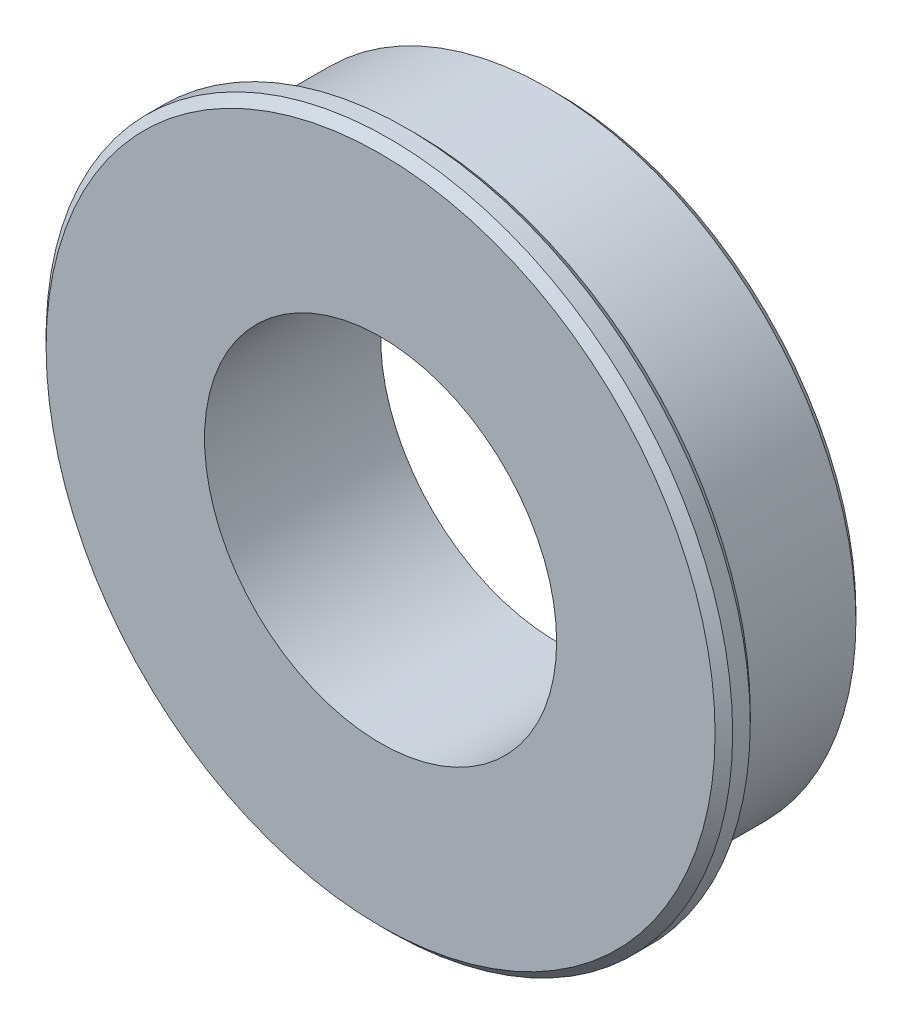
ISO-10303-21;
HEADER;
FILE_DESCRIPTION(('STEP AP214'),'2;1');
FILE_NAME('part.step','',(''),(''),'','','');
FILE_SCHEMA(('AUTOMOTIVE_DESIGN { 1 0 10303 214 1 1 1 1 }'));
ENDSEC;
DATA;
#1=APPLICATION_CONTEXT('core data for automotive mechanical design processes');
#2=APPLICATION_PROTOCOL_DEFINITION('international standard','automotive_design',2000,#1);
#3=PRODUCT_CONTEXT('',#1,'mechanical');
#4=PRODUCT('Part','Part','',(#3));
#5=PRODUCT_RELATED_PRODUCT_CATEGORY('part','',(#4));
#6=PRODUCT_DEFINITION_FORMATION('','',#4);
#7=PRODUCT_DEFINITION_CONTEXT('part definition',#1,'design');
#8=PRODUCT_DEFINITION('design','',#6,#7);
#9=PRODUCT_DEFINITION_SHAPE('','',#8);
#10=(LENGTH_UNIT() NAMED_UNIT(*) SI_UNIT(.MILLI.,.METRE.));
#11=(NAMED_UNIT(*) PLANE_ANGLE_UNIT() SI_UNIT($,.RADIAN.));
#12=(NAMED_UNIT(*) SI_UNIT($,.STERADIAN.) SOLID_ANGLE_UNIT());
#13=UNCERTAINTY_MEASURE_WITH_UNIT(LENGTH_MEASURE(1.E-05),#10,'distance_accuracy_value','');
#14=(GEOMETRIC_REPRESENTATION_CONTEXT(3) GLOBAL_UNCERTAINTY_ASSIGNED_CONTEXT((#13)) GLOBAL_UNIT_ASSIGNED_CONTEXT((#10,
#11,#12)) REPRESENTATION_CONTEXT('',''));
#15=CARTESIAN_POINT('',(0.,0.,0.));
#16=DIRECTION('',(0.,0.,1.));
#17=DIRECTION('',(1.,0.,0.));
#18=AXIS2_PLACEMENT_3D('',#15,#16,#17);
#19=CARTESIAN_POINT('',(0.,0.,2.));
#20=DIRECTION('',(0.,0.,-1.));
#21=DIRECTION('',(-1.,0.,0.));
#22=AXIS2_PLACEMENT_3D('',#19,#20,#21);
#23=CYLINDRICAL_SURFACE('',#22,7.);
#24=CARTESIAN_POINT('',(0.,0.,-1.8));
#25=DIRECTION('',(0.,0.,1.));
#26=DIRECTION('',(1.,0.,0.));
#27=AXIS2_PLACEMENT_3D('',#24,#25,#26);
#28=CIRCLE('',#27,7.);
#29=CARTESIAN_POINT('',(7.,0.,-1.8));
#30=VERTEX_POINT('',#29);
#31=EDGE_CURVE('E57',#30,#30,#28,.T.);
#32=ORIENTED_EDGE('',*,*,#31,.T.);
#33=EDGE_LOOP('',(#32));
#34=FACE_BOUND('',#33,.T.);
#35=CARTESIAN_POINT('',(0.,0.,1.2));
#36=DIRECTION('',(0.,0.,1.));
#37=DIRECTION('',(1.,0.,0.));
#38=AXIS2_PLACEMENT_3D('',#35,#36,#37);
#39=CIRCLE('',#38,7.);
#40=CARTESIAN_POINT('',(7.,0.,1.2));
#41=VERTEX_POINT('',#40);
#42=EDGE_CURVE('E60',#41,#41,#39,.T.);
#43=ORIENTED_EDGE('',*,*,#42,.F.);
#44=EDGE_LOOP('',(#43));
#45=FACE_BOUND('',#44,.T.);
#46=ADVANCED_FACE('F33',(#34,#45),#23,.T.);
#47=CARTESIAN_POINT('',(0.,0.,2.));
#48=DIRECTION('',(0.,0.,1.));
#49=DIRECTION('',(1.,0.,0.));
#50=AXIS2_PLACEMENT_3D('',#47,#48,#49);
#51=PLANE('',#50);
#52=CARTESIAN_POINT('',(0.,0.,2.));
#53=DIRECTION('',(0.,0.,1.));
#54=DIRECTION('',(1.,0.,0.));
#55=AXIS2_PLACEMENT_3D('',#52,#53,#54);
#56=CIRCLE('',#55,7.6);
#57=CARTESIAN_POINT('',(7.6,0.,2.));
#58=VERTEX_POINT('',#57);
#59=EDGE_CURVE('E10',#58,#58,#56,.T.);
#60=ORIENTED_EDGE('',*,*,#59,.T.);
#61=EDGE_LOOP('',(#60));
#62=FACE_BOUND('',#61,.T.);
#63=CARTESIAN_POINT('',(0.,0.,2.));
#64=DIRECTION('',(0.,0.,1.));
#65=DIRECTION('',(1.,0.,0.));
#66=AXIS2_PLACEMENT_3D('',#63,#64,#65);
#67=CIRCLE('',#66,4.);
#68=CARTESIAN_POINT('',(4.,0.,2.));
#69=VERTEX_POINT('',#68);
#70=EDGE_CURVE('E64',#69,#69,#67,.T.);
#71=ORIENTED_EDGE('',*,*,#70,.F.);
#72=EDGE_LOOP('',(#71));
#73=FACE_BOUND('',#72,.T.);
#74=ADVANCED_FACE('F73',(#62,#73),#51,.T.);
#75=CARTESIAN_POINT('',(0.,0.,-2.));
#76=DIRECTION('',(0.,0.,1.));
#77=DIRECTION('',(1.,0.,0.));
#78=AXIS2_PLACEMENT_3D('',#75,#76,#77);
#79=PLANE('',#78);
#80=CARTESIAN_POINT('',(0.,0.,-2.));
#81=DIRECTION('',(0.,0.,1.));
#82=DIRECTION('',(1.,0.,0.));
#83=AXIS2_PLACEMENT_3D('',#80,#81,#82);
#84=CIRCLE('',#83,6.8);
#85=CARTESIAN_POINT('',(6.8,0.,-2.));
#86=VERTEX_POINT('',#85);
#87=EDGE_CURVE('E54',#86,#86,#84,.F.);
#88=ORIENTED_EDGE('',*,*,#87,.T.);
#89=EDGE_LOOP('',(#88));
#90=FACE_BOUND('',#89,.T.);
#91=CARTESIAN_POINT('',(0.,0.,-2.));
#92=DIRECTION('',(0.,0.,1.));
#93=DIRECTION('',(1.,0.,0.));
#94=AXIS2_PLACEMENT_3D('',#91,#92,#93);
#95=CIRCLE('',#94,4.);
#96=CARTESIAN_POINT('',(4.,0.,-2.));
#97=VERTEX_POINT('',#96);
#98=EDGE_CURVE('E61',#97,#97,#95,.T.);
#99=ORIENTED_EDGE('',*,*,#98,.T.);
#100=EDGE_LOOP('',(#99));
#101=FACE_BOUND('',#100,.T.);
#102=ADVANCED_FACE('F79',(#90,#101),#79,.F.);
#103=CARTESIAN_POINT('',(0.,0.,2.));
#104=DIRECTION('',(0.,0.,-1.));
#105=DIRECTION('',(-1.,0.,0.));
#106=AXIS2_PLACEMENT_3D('',#103,#104,#105);
#107=CYLINDRICAL_SURFACE('',#106,4.);
#108=ORIENTED_EDGE('',*,*,#70,.T.);
#109=EDGE_LOOP('',(#108));
#110=FACE_BOUND('',#109,.T.);
#111=ORIENTED_EDGE('',*,*,#98,.F.);
#112=EDGE_LOOP('',(#111));
#113=FACE_BOUND('',#112,.T.);
#114=ADVANCED_FACE('F111',(#110,#113),#107,.F.);
#115=CARTESIAN_POINT('',(0.,0.,1.2));
#116=DIRECTION('',(0.,0.,1.));
#117=DIRECTION('',(1.,0.,0.));
#118=AXIS2_PLACEMENT_3D('',#115,#116,#117);
#119=PLANE('',#118);
#120=CARTESIAN_POINT('',(0.,0.,1.2));
#121=DIRECTION('',(0.,0.,1.));
#122=DIRECTION('',(1.,0.,0.));
#123=AXIS2_PLACEMENT_3D('',#120,#121,#122);
#124=CIRCLE('',#123,7.6);
#125=CARTESIAN_POINT('',(7.6,0.,1.2));
#126=VERTEX_POINT('',#125);
#127=EDGE_CURVE('E41',#126,#126,#124,.F.);
#128=ORIENTED_EDGE('',*,*,#127,.T.);
#129=EDGE_LOOP('',(#128));
#130=FACE_BOUND('',#129,.T.);
#131=ORIENTED_EDGE('',*,*,#42,.T.);
#132=EDGE_LOOP('',(#131));
#133=FACE_BOUND('',#132,.T.);
#134=ADVANCED_FACE('F70',(#130,#133),#119,.F.);
#135=CARTESIAN_POINT('',(0.,0.,1.2));
#136=DIRECTION('',(0.,0.,1.));
#137=DIRECTION('',(1.,0.,0.));
#138=AXIS2_PLACEMENT_3D('',#135,#136,#137);
#139=CYLINDRICAL_SURFACE('',#138,7.8);
#140=CARTESIAN_POINT('',(0.,0.,1.4));
#141=DIRECTION('',(0.,0.,1.));
#142=DIRECTION('',(1.,0.,0.));
#143=AXIS2_PLACEMENT_3D('',#140,#141,#142);
#144=CIRCLE('',#143,7.8);
#145=CARTESIAN_POINT('',(7.8,0.,1.4));
#146=VERTEX_POINT('',#145);
#147=EDGE_CURVE('E45',#146,#146,#144,.T.);
#148=ORIENTED_EDGE('',*,*,#147,.T.);
#149=EDGE_LOOP('',(#148));
#150=FACE_BOUND('',#149,.T.);
#151=CARTESIAN_POINT('',(0.,0.,1.8));
#152=DIRECTION('',(0.,0.,1.));
#153=DIRECTION('',(1.,0.,0.));
#154=AXIS2_PLACEMENT_3D('',#151,#152,#153);
#155=CIRCLE('',#154,7.8);
#156=CARTESIAN_POINT('',(7.8,0.,1.8));
#157=VERTEX_POINT('',#156);
#158=EDGE_CURVE('E49',#157,#157,#155,.F.);
#159=ORIENTED_EDGE('',*,*,#158,.T.);
#160=EDGE_LOOP('',(#159));
#161=FACE_BOUND('',#160,.T.);
#162=ADVANCED_FACE('F90',(#150,#161),#139,.T.);
#163=CARTESIAN_POINT('',(0.,0.,-1.8));
#164=DIRECTION('',(0.,0.,1.));
#165=DIRECTION('',(1.,0.,0.));
#166=AXIS2_PLACEMENT_3D('',#163,#164,#165);
#167=CONICAL_SURFACE('',#166,7.,0.785398163397455);
#168=ORIENTED_EDGE('',*,*,#87,.F.);
#169=EDGE_LOOP('',(#168));
#170=FACE_BOUND('',#169,.T.);
#171=ORIENTED_EDGE('',*,*,#31,.F.);
#172=EDGE_LOOP('',(#171));
#173=FACE_BOUND('',#172,.T.);
#174=ADVANCED_FACE('F84',(#170,#173),#167,.T.);
#175=CARTESIAN_POINT('',(0.,0.,1.4));
#176=DIRECTION('',(0.,0.,1.));
#177=DIRECTION('',(1.,0.,0.));
#178=AXIS2_PLACEMENT_3D('',#175,#176,#177);
#179=CONICAL_SURFACE('',#178,7.8,0.785398163397455);
#180=ORIENTED_EDGE('',*,*,#127,.F.);
#181=EDGE_LOOP('',(#180));
#182=FACE_BOUND('',#181,.T.);
#183=ORIENTED_EDGE('',*,*,#147,.F.);
#184=EDGE_LOOP('',(#183));
#185=FACE_BOUND('',#184,.T.);
#186=ADVANCED_FACE('F89',(#182,#185),#179,.T.);
#187=CARTESIAN_POINT('',(0.,0.,2.));
#188=DIRECTION('',(0.,0.,-1.));
#189=DIRECTION('',(-1.,0.,0.));
#190=AXIS2_PLACEMENT_3D('',#187,#188,#189);
#191=CONICAL_SURFACE('',#190,7.6,0.78539816339744);
#192=ORIENTED_EDGE('',*,*,#158,.F.);
#193=EDGE_LOOP('',(#192));
#194=FACE_BOUND('',#193,.T.);
#195=ORIENTED_EDGE('',*,*,#59,.F.);
#196=EDGE_LOOP('',(#195));
#197=FACE_BOUND('',#196,.T.);
#198=ADVANCED_FACE('F36',(#194,#197),#191,.T.);
#199=CLOSED_SHELL('',(#46,#74,#102,#114,#134,#162,#174,#186,#198));
#200=MANIFOLD_SOLID_BREP('B2',#199);
#201=ADVANCED_BREP_SHAPE_REPRESENTATION('',(#18,#200),#14);
#202=SHAPE_DEFINITION_REPRESENTATION(#9,#201);
ENDSEC;
END-ISO-10303-21;
